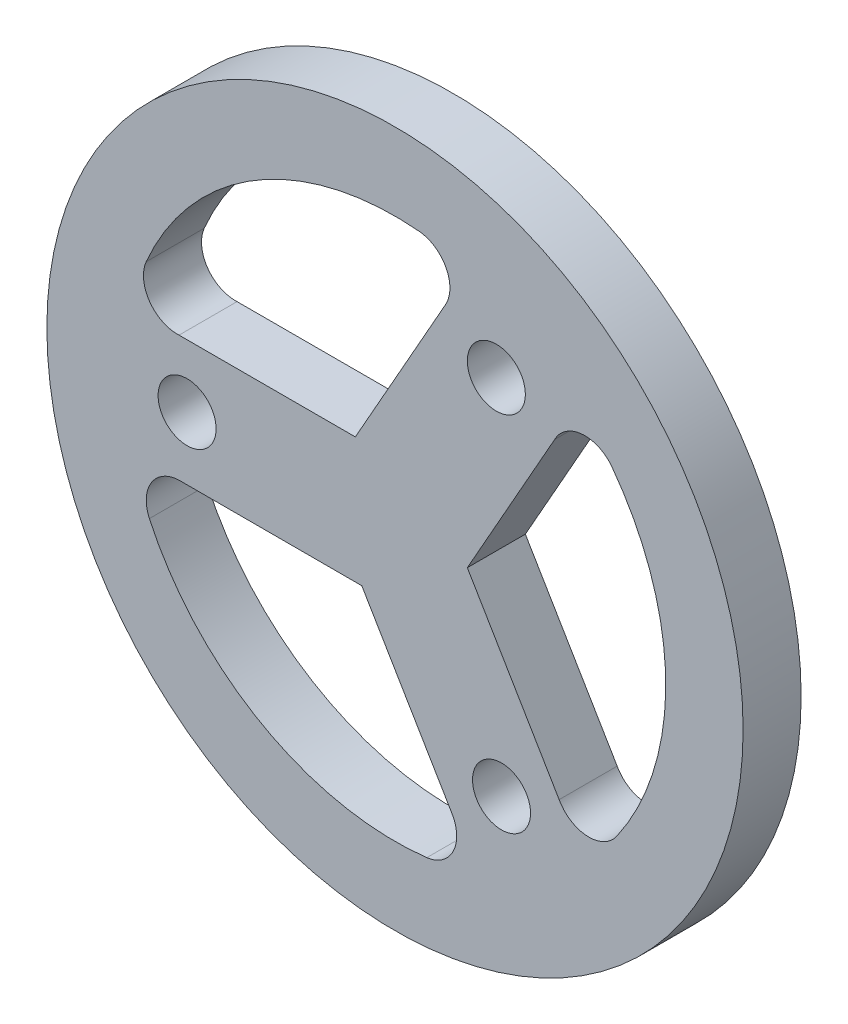
ISO-10303-21;
HEADER;
FILE_DESCRIPTION(('STEP AP214'),'2;1');
FILE_NAME('part.step','',(''),(''),'','','');
FILE_SCHEMA(('AUTOMOTIVE_DESIGN { 1 0 10303 214 1 1 1 1 }'));
ENDSEC;
DATA;
#1=APPLICATION_CONTEXT('core data for automotive mechanical design processes');
#2=APPLICATION_PROTOCOL_DEFINITION('international standard','automotive_design',2000,#1);
#3=PRODUCT_CONTEXT('',#1,'mechanical');
#4=PRODUCT('Part','Part','',(#3));
#5=PRODUCT_RELATED_PRODUCT_CATEGORY('part','',(#4));
#6=PRODUCT_DEFINITION_FORMATION('','',#4);
#7=PRODUCT_DEFINITION_CONTEXT('part definition',#1,'design');
#8=PRODUCT_DEFINITION('design','',#6,#7);
#9=PRODUCT_DEFINITION_SHAPE('','',#8);
#10=(LENGTH_UNIT() NAMED_UNIT(*) SI_UNIT(.MILLI.,.METRE.));
#11=(NAMED_UNIT(*) PLANE_ANGLE_UNIT() SI_UNIT($,.RADIAN.));
#12=(NAMED_UNIT(*) SI_UNIT($,.STERADIAN.) SOLID_ANGLE_UNIT());
#13=UNCERTAINTY_MEASURE_WITH_UNIT(LENGTH_MEASURE(1.E-05),#10,'distance_accuracy_value','');
#14=(GEOMETRIC_REPRESENTATION_CONTEXT(3) GLOBAL_UNCERTAINTY_ASSIGNED_CONTEXT((#13)) GLOBAL_UNIT_ASSIGNED_CONTEXT((#10,
#11,#12)) REPRESENTATION_CONTEXT('',''));
#15=CARTESIAN_POINT('',(0.,0.,0.));
#16=DIRECTION('',(0.,0.,1.));
#17=DIRECTION('',(1.,0.,0.));
#18=AXIS2_PLACEMENT_3D('',#15,#16,#17);
#19=CARTESIAN_POINT('',(0.,0.,3.));
#20=DIRECTION('',(0.,0.,1.));
#21=DIRECTION('',(1.,0.,0.));
#22=AXIS2_PLACEMENT_3D('',#19,#20,#21);
#23=PLANE('',#22);
#24=CARTESIAN_POINT('',(5.24045327565877,9.38616798622511,3.));
#25=DIRECTION('',(0.,0.,1.));
#26=DIRECTION('',(1.,0.,0.));
#27=AXIS2_PLACEMENT_3D('',#24,#25,#26);
#28=CIRCLE('',#27,1.49999999999964);
#29=CARTESIAN_POINT('',(6.74045327565841,9.38616798622511,3.));
#30=VERTEX_POINT('',#29);
#31=EDGE_CURVE('E178',#30,#30,#28,.T.);
#32=ORIENTED_EDGE('',*,*,#31,.F.);
#33=EDGE_LOOP('',(#32));
#34=FACE_BOUND('',#33,.T.);
#35=CARTESIAN_POINT('',(1.08966141724626,12.2014399968107,3.));
#36=DIRECTION('',(0.,0.,1.));
#37=DIRECTION('',(1.,0.,0.));
#38=AXIS2_PLACEMENT_3D('',#35,#36,#37);
#39=CIRCLE('',#38,1.74999999999958);
#40=CARTESIAN_POINT('',(2.58509341993936,11.2924938348628,3.));
#41=VERTEX_POINT('',#40);
#42=CARTESIAN_POINT('',(1.24532733399569,13.9445028534976,3.));
#43=VERTEX_POINT('',#42);
#44=EDGE_CURVE('E246',#41,#43,#39,.T.);
#45=ORIENTED_EDGE('',*,*,#44,.F.);
#46=DIRECTION('',(0.491860621701086,0.870673950925271,0.));
#47=VECTOR('',#46,1.);
#48=CARTESIAN_POINT('',(2.58509341993926,11.2924938348629,3.));
#49=LINE('',#48,#47);
#50=CARTESIAN_POINT('',(-2.05012200752725,3.08740249076528,3.));
#51=VERTEX_POINT('',#50);
#52=EDGE_CURVE('E244',#51,#41,#49,.T.);
#53=ORIENTED_EDGE('',*,*,#52,.F.);
#54=DIRECTION('',(1.,0.,0.));
#55=VECTOR('',#54,1.);
#56=CARTESIAN_POINT('',(-11.1656200392104,3.08740249076528,3.));
#57=LINE('',#56,#55);
#58=CARTESIAN_POINT('',(-11.1656200392104,3.08740249076528,3.));
#59=VERTEX_POINT('',#58);
#60=EDGE_CURVE('E254',#59,#51,#57,.T.);
#61=ORIENTED_EDGE('',*,*,#60,.F.);
#62=CARTESIAN_POINT('',(-11.2554135488902,4.83509729410464,3.));
#63=DIRECTION('',(0.,0.,1.));
#64=DIRECTION('',(1.,0.,0.));
#65=AXIS2_PLACEMENT_3D('',#62,#63,#64);
#66=CIRCLE('',#65,1.75000000000001);
#67=CARTESIAN_POINT('',(-12.8633297701603,5.52582547897669,3.));
#68=VERTEX_POINT('',#67);
#69=EDGE_CURVE('E251',#68,#59,#66,.T.);
#70=ORIENTED_EDGE('',*,*,#69,.F.);
#71=CARTESIAN_POINT('',(0.,0.,3.));
#72=DIRECTION('',(0.,0.,1.));
#73=DIRECTION('',(1.,0.,0.));
#74=AXIS2_PLACEMENT_3D('',#71,#72,#73);
#75=CIRCLE('',#74,14.);
#76=EDGE_CURVE('E249',#43,#68,#75,.T.);
#77=ORIENTED_EDGE('',*,*,#76,.F.);
#78=EDGE_LOOP('',(#45,#53,#61,#70,#77));
#79=FACE_BOUND('',#78,.T.);
#80=CARTESIAN_POINT('',(0.,0.,3.));
#81=DIRECTION('',(0.,0.,1.));
#82=DIRECTION('',(1.,0.,0.));
#83=AXIS2_PLACEMENT_3D('',#80,#81,#82);
#84=CIRCLE('',#83,18.);
#85=CARTESIAN_POINT('',(18.,0.,3.));
#86=VERTEX_POINT('',#85);
#87=EDGE_CURVE('E11',#86,#86,#84,.T.);
#88=ORIENTED_EDGE('',*,*,#87,.T.);
#89=EDGE_LOOP('',(#88));
#90=FACE_BOUND('',#89,.T.);
#91=CARTESIAN_POINT('',(5.5084332824298,-9.23144965717842,3.));
#92=DIRECTION('',(0.,0.,1.));
#93=DIRECTION('',(1.,0.,0.));
#94=AXIS2_PLACEMENT_3D('',#91,#92,#93);
#95=CIRCLE('',#94,1.49999999999968);
#96=CARTESIAN_POINT('',(7.00843328242948,-9.23144965717842,3.));
#97=VERTEX_POINT('',#96);
#98=EDGE_CURVE('E238',#97,#97,#95,.T.);
#99=ORIENTED_EDGE('',*,*,#98,.F.);
#100=EDGE_LOOP('',(#99));
#101=FACE_BOUND('',#100,.T.);
#102=CARTESIAN_POINT('',(5.63653638202065,-9.4461345329261,3.));
#103=DIRECTION('',(0.,0.,-1.));
#104=DIRECTION('',(1.,0.,0.));
#105=AXIS2_PLACEMENT_3D('',#102,#103,#104);
#106=CIRCLE('',#105,3.25000000000002);
#107=CARTESIAN_POINT('',(2.90904103089509,-11.2134118483434,3.));
#108=VERTEX_POINT('',#107);
#109=CARTESIAN_POINT('',(2.77697806435651,-10.99061704428,3.));
#110=VERTEX_POINT('',#109);
#111=EDGE_CURVE('E195',#108,#110,#106,.T.);
#112=ORIENTED_EDGE('',*,*,#111,.F.);
#113=CARTESIAN_POINT('',(1.4403896879811,-12.1650227104908,3.));
#114=DIRECTION('',(0.,0.,1.));
#115=DIRECTION('',(1.,0.,0.));
#116=AXIS2_PLACEMENT_3D('',#113,#114,#115);
#117=CIRCLE('',#116,1.75000000000001);
#118=CARTESIAN_POINT('',(1.64615964340708,-13.9028830977038,3.));
#119=VERTEX_POINT('',#118);
#120=EDGE_CURVE('E193',#119,#108,#117,.T.);
#121=ORIENTED_EDGE('',*,*,#120,.F.);
#122=CARTESIAN_POINT('',(0.,0.,3.));
#123=DIRECTION('',(0.,0.,1.));
#124=DIRECTION('',(1.,0.,0.));
#125=AXIS2_PLACEMENT_3D('',#122,#123,#124);
#126=CIRCLE('',#125,14.);
#127=CARTESIAN_POINT('',(-12.6989573812714,-5.8937663194814,3.));
#128=VERTEX_POINT('',#127);
#129=EDGE_CURVE('E205',#128,#119,#126,.T.);
#130=ORIENTED_EDGE('',*,*,#129,.F.);
#131=CARTESIAN_POINT('',(-11.1115877086127,-5.15704552954634,3.));
#132=DIRECTION('',(0.,0.,1.));
#133=DIRECTION('',(1.,0.,0.));
#134=AXIS2_PLACEMENT_3D('',#131,#132,#133);
#135=CIRCLE('',#134,1.74999999999958);
#136=CARTESIAN_POINT('',(-11.07213324304,-3.40749034460804,3.));
#137=VERTEX_POINT('',#136);
#138=EDGE_CURVE('E202',#137,#128,#135,.T.);
#139=ORIENTED_EDGE('',*,*,#138,.F.);
#140=DIRECTION('',(-0.999999973210807,0.000231470052131784,0.));
#141=VECTOR('',#140,1.);
#142=CARTESIAN_POINT('',(-11.07213324304,-3.40749034460804,3.));
#143=LINE('',#142,#141);
#144=CARTESIAN_POINT('',(-1.71668249725915,-3.4096558513379,3.));
#145=VERTEX_POINT('',#144);
#146=EDGE_CURVE('E200',#145,#137,#143,.T.);
#147=ORIENTED_EDGE('',*,*,#146,.F.);
#148=DIRECTION('',(-0.509906448719429,0.860229860882741,0.));
#149=VECTOR('',#148,1.);
#150=CARTESIAN_POINT('',(2.77697806435651,-10.99061704428,3.));
#151=LINE('',#150,#149);
#152=EDGE_CURVE('E198',#110,#145,#151,.T.);
#153=ORIENTED_EDGE('',*,*,#152,.F.);
#154=EDGE_LOOP('',(#112,#121,#130,#139,#147,#153));
#155=FACE_BOUND('',#154,.T.);
#156=CARTESIAN_POINT('',(0.,0.,3.));
#157=DIRECTION('',(0.,0.,1.));
#158=DIRECTION('',(1.,0.,0.));
#159=AXIS2_PLACEMENT_3D('',#156,#157,#158);
#160=CIRCLE('',#159,14.);
#161=CARTESIAN_POINT('',(11.4536300472757,-8.05073653401622,3.));
#162=VERTEX_POINT('',#161);
#163=CARTESIAN_POINT('',(11.2171701267533,8.37705761872707,3.));
#164=VERTEX_POINT('',#163);
#165=EDGE_CURVE('E154',#162,#164,#160,.T.);
#166=ORIENTED_EDGE('',*,*,#165,.F.);
#167=CARTESIAN_POINT('',(10.0219262913665,-7.04439446726436,3.));
#168=DIRECTION('',(0.,0.,1.));
#169=DIRECTION('',(1.,0.,0.));
#170=AXIS2_PLACEMENT_3D('',#167,#168,#169);
#171=CIRCLE('',#170,1.74999999999959);
#172=CARTESIAN_POINT('',(8.48703982310076,-7.88500349025481,3.));
#173=VERTEX_POINT('',#172);
#174=EDGE_CURVE('E146',#173,#162,#171,.T.);
#175=ORIENTED_EDGE('',*,*,#174,.F.);
#176=DIRECTION('',(0.509705666222612,-0.860348844260608,0.));
#177=VECTOR('',#176,1.);
#178=CARTESIAN_POINT('',(8.48703982310076,-7.88500349025481,3.));
#179=LINE('',#178,#177);
#180=CARTESIAN_POINT('',(3.74032239780717,0.127135910015121,3.));
#181=VERTEX_POINT('',#180);
#182=EDGE_CURVE('E175',#181,#173,#179,.T.);
#183=ORIENTED_EDGE('',*,*,#182,.F.);
#184=DIRECTION('',(-0.491657400648019,-0.870788723163107,0.));
#185=VECTOR('',#184,1.);
#186=CARTESIAN_POINT('',(8.25657900831527,8.12600935757812,3.));
#187=LINE('',#186,#185);
#188=CARTESIAN_POINT('',(8.25657900831527,8.12600935757811,3.));
#189=VERTEX_POINT('',#188);
#190=EDGE_CURVE('E170',#189,#181,#187,.T.);
#191=ORIENTED_EDGE('',*,*,#190,.F.);
#192=CARTESIAN_POINT('',(9.81502386090915,7.32992541638618,3.));
#193=DIRECTION('',(0.,0.,1.));
#194=DIRECTION('',(1.,0.,0.));
#195=AXIS2_PLACEMENT_3D('',#192,#193,#194);
#196=CIRCLE('',#195,1.75000000000001);
#197=EDGE_CURVE('E168',#164,#189,#196,.T.);
#198=ORIENTED_EDGE('',*,*,#197,.F.);
#199=EDGE_LOOP('',(#166,#175,#183,#191,#198));
#200=FACE_BOUND('',#199,.T.);
#201=CARTESIAN_POINT('',(-10.7488865580886,-0.15471832904669,3.));
#202=DIRECTION('',(0.,0.,1.));
#203=DIRECTION('',(1.,0.,0.));
#204=AXIS2_PLACEMENT_3D('',#201,#202,#203);
#205=CIRCLE('',#204,1.49999999999971);
#206=CARTESIAN_POINT('',(-9.24888655808885,-0.15471832904669,3.));
#207=VERTEX_POINT('',#206);
#208=EDGE_CURVE('E302',#207,#207,#205,.T.);
#209=ORIENTED_EDGE('',*,*,#208,.F.);
#210=EDGE_LOOP('',(#209));
#211=FACE_BOUND('',#210,.T.);
#212=ADVANCED_FACE('F33',(#34,#79,#90,#101,#155,#200,#211),#23,.T.);
#213=CARTESIAN_POINT('',(0.,0.,0.));
#214=DIRECTION('',(0.,0.,1.));
#215=DIRECTION('',(1.,0.,0.));
#216=AXIS2_PLACEMENT_3D('',#213,#214,#215);
#217=PLANE('',#216);
#218=CARTESIAN_POINT('',(1.4403896879811,-12.1650227104908,0.));
#219=DIRECTION('',(0.,0.,1.));
#220=DIRECTION('',(1.,0.,0.));
#221=AXIS2_PLACEMENT_3D('',#218,#219,#220);
#222=CIRCLE('',#221,1.75000000000001);
#223=CARTESIAN_POINT('',(1.64615964340708,-13.9028830977038,0.));
#224=VERTEX_POINT('',#223);
#225=CARTESIAN_POINT('',(2.90904103089509,-11.2134118483434,0.));
#226=VERTEX_POINT('',#225);
#227=EDGE_CURVE('E162',#224,#226,#222,.T.);
#228=ORIENTED_EDGE('',*,*,#227,.T.);
#229=CARTESIAN_POINT('',(5.63653638202065,-9.4461345329261,0.));
#230=DIRECTION('',(0.,0.,-1.));
#231=DIRECTION('',(1.,0.,0.));
#232=AXIS2_PLACEMENT_3D('',#229,#230,#231);
#233=CIRCLE('',#232,3.25000000000002);
#234=CARTESIAN_POINT('',(2.77697806435651,-10.99061704428,0.));
#235=VERTEX_POINT('',#234);
#236=EDGE_CURVE('E210',#226,#235,#233,.T.);
#237=ORIENTED_EDGE('',*,*,#236,.T.);
#238=DIRECTION('',(-0.509906448719429,0.860229860882741,0.));
#239=VECTOR('',#238,1.);
#240=CARTESIAN_POINT('',(2.77697806435651,-10.99061704428,0.));
#241=LINE('',#240,#239);
#242=CARTESIAN_POINT('',(-1.71668249725915,-3.4096558513379,0.));
#243=VERTEX_POINT('',#242);
#244=EDGE_CURVE('E213',#235,#243,#241,.T.);
#245=ORIENTED_EDGE('',*,*,#244,.T.);
#246=DIRECTION('',(-0.999999973210807,0.000231470052131784,0.));
#247=VECTOR('',#246,1.);
#248=CARTESIAN_POINT('',(-11.07213324304,-3.40749034460804,0.));
#249=LINE('',#248,#247);
#250=CARTESIAN_POINT('',(-11.07213324304,-3.40749034460804,0.));
#251=VERTEX_POINT('',#250);
#252=EDGE_CURVE('E216',#243,#251,#249,.T.);
#253=ORIENTED_EDGE('',*,*,#252,.T.);
#254=CARTESIAN_POINT('',(-11.1115877086127,-5.15704552954634,0.));
#255=DIRECTION('',(0.,0.,1.));
#256=DIRECTION('',(1.,0.,0.));
#257=AXIS2_PLACEMENT_3D('',#254,#255,#256);
#258=CIRCLE('',#257,1.74999999999958);
#259=CARTESIAN_POINT('',(-12.6989573812713,-5.89376631948135,0.));
#260=VERTEX_POINT('',#259);
#261=EDGE_CURVE('E219',#251,#260,#258,.T.);
#262=ORIENTED_EDGE('',*,*,#261,.T.);
#263=CARTESIAN_POINT('',(0.,0.,0.));
#264=DIRECTION('',(0.,0.,1.));
#265=DIRECTION('',(1.,0.,0.));
#266=AXIS2_PLACEMENT_3D('',#263,#264,#265);
#267=CIRCLE('',#266,14.);
#268=EDGE_CURVE('E196',#260,#224,#267,.T.);
#269=ORIENTED_EDGE('',*,*,#268,.T.);
#270=EDGE_LOOP('',(#228,#237,#245,#253,#262,#269));
#271=FACE_BOUND('',#270,.T.);
#272=CARTESIAN_POINT('',(0.,0.,0.));
#273=DIRECTION('',(0.,0.,1.));
#274=DIRECTION('',(1.,0.,0.));
#275=AXIS2_PLACEMENT_3D('',#272,#273,#274);
#276=CIRCLE('',#275,18.);
#277=CARTESIAN_POINT('',(18.,0.,0.));
#278=VERTEX_POINT('',#277);
#279=EDGE_CURVE('E37',#278,#278,#276,.T.);
#280=ORIENTED_EDGE('',*,*,#279,.F.);
#281=EDGE_LOOP('',(#280));
#282=FACE_BOUND('',#281,.T.);
#283=DIRECTION('',(0.491860621701086,0.870673950925271,0.));
#284=VECTOR('',#283,1.);
#285=CARTESIAN_POINT('',(2.58509341993926,11.2924938348629,0.));
#286=LINE('',#285,#284);
#287=CARTESIAN_POINT('',(-2.05012200752725,3.08740249076528,0.));
#288=VERTEX_POINT('',#287);
#289=CARTESIAN_POINT('',(2.58509341993936,11.2924938348628,0.));
#290=VERTEX_POINT('',#289);
#291=EDGE_CURVE('E241',#288,#290,#286,.T.);
#292=ORIENTED_EDGE('',*,*,#291,.T.);
#293=CARTESIAN_POINT('',(1.08966141724626,12.2014399968107,0.));
#294=DIRECTION('',(0.,0.,1.));
#295=DIRECTION('',(1.,0.,0.));
#296=AXIS2_PLACEMENT_3D('',#293,#294,#295);
#297=CIRCLE('',#296,1.74999999999958);
#298=CARTESIAN_POINT('',(1.24532733399569,13.9445028534976,0.));
#299=VERTEX_POINT('',#298);
#300=EDGE_CURVE('E259',#290,#299,#297,.T.);
#301=ORIENTED_EDGE('',*,*,#300,.T.);
#302=CARTESIAN_POINT('',(0.,0.,0.));
#303=DIRECTION('',(0.,0.,1.));
#304=DIRECTION('',(1.,0.,0.));
#305=AXIS2_PLACEMENT_3D('',#302,#303,#304);
#306=CIRCLE('',#305,14.);
#307=CARTESIAN_POINT('',(-12.8633297701603,5.52582547897669,0.));
#308=VERTEX_POINT('',#307);
#309=EDGE_CURVE('E262',#299,#308,#306,.T.);
#310=ORIENTED_EDGE('',*,*,#309,.T.);
#311=CARTESIAN_POINT('',(-11.2554135488902,4.83509729410464,0.));
#312=DIRECTION('',(0.,0.,1.));
#313=DIRECTION('',(1.,0.,0.));
#314=AXIS2_PLACEMENT_3D('',#311,#312,#313);
#315=CIRCLE('',#314,1.75000000000001);
#316=CARTESIAN_POINT('',(-11.1656200392104,3.08740249076528,0.));
#317=VERTEX_POINT('',#316);
#318=EDGE_CURVE('E265',#308,#317,#315,.T.);
#319=ORIENTED_EDGE('',*,*,#318,.T.);
#320=DIRECTION('',(1.,0.,0.));
#321=VECTOR('',#320,1.);
#322=CARTESIAN_POINT('',(-11.1656200392104,3.08740249076528,0.));
#323=LINE('',#322,#321);
#324=EDGE_CURVE('E247',#317,#288,#323,.T.);
#325=ORIENTED_EDGE('',*,*,#324,.T.);
#326=EDGE_LOOP('',(#292,#301,#310,#319,#325));
#327=FACE_BOUND('',#326,.T.);
#328=CARTESIAN_POINT('',(5.5084332824298,-9.23144965717842,0.));
#329=DIRECTION('',(0.,0.,1.));
#330=DIRECTION('',(1.,0.,0.));
#331=AXIS2_PLACEMENT_3D('',#328,#329,#330);
#332=CIRCLE('',#331,1.49999999999968);
#333=CARTESIAN_POINT('',(7.00843328242948,-9.23144965717842,0.));
#334=VERTEX_POINT('',#333);
#335=EDGE_CURVE('E237',#334,#334,#332,.T.);
#336=ORIENTED_EDGE('',*,*,#335,.T.);
#337=EDGE_LOOP('',(#336));
#338=FACE_BOUND('',#337,.T.);
#339=CARTESIAN_POINT('',(10.0219262913665,-7.04439446726436,0.));
#340=DIRECTION('',(0.,0.,1.));
#341=DIRECTION('',(1.,0.,0.));
#342=AXIS2_PLACEMENT_3D('',#339,#340,#341);
#343=CIRCLE('',#342,1.74999999999959);
#344=CARTESIAN_POINT('',(8.48703982310076,-7.88500349025481,0.));
#345=VERTEX_POINT('',#344);
#346=CARTESIAN_POINT('',(11.4536300472757,-8.05073653401622,0.));
#347=VERTEX_POINT('',#346);
#348=EDGE_CURVE('E56',#345,#347,#343,.T.);
#349=ORIENTED_EDGE('',*,*,#348,.T.);
#350=CARTESIAN_POINT('',(0.,0.,0.));
#351=DIRECTION('',(0.,0.,1.));
#352=DIRECTION('',(1.,0.,0.));
#353=AXIS2_PLACEMENT_3D('',#350,#351,#352);
#354=CIRCLE('',#353,14.);
#355=CARTESIAN_POINT('',(11.2171701267533,8.37705761872707,0.));
#356=VERTEX_POINT('',#355);
#357=EDGE_CURVE('E161',#347,#356,#354,.T.);
#358=ORIENTED_EDGE('',*,*,#357,.T.);
#359=CARTESIAN_POINT('',(9.81502386090915,7.32992541638618,0.));
#360=DIRECTION('',(0.,0.,1.));
#361=DIRECTION('',(1.,0.,0.));
#362=AXIS2_PLACEMENT_3D('',#359,#360,#361);
#363=CIRCLE('',#362,1.75000000000001);
#364=CARTESIAN_POINT('',(8.25657900831527,8.12600935757811,0.));
#365=VERTEX_POINT('',#364);
#366=EDGE_CURVE('E180',#356,#365,#363,.T.);
#367=ORIENTED_EDGE('',*,*,#366,.T.);
#368=DIRECTION('',(-0.491657400648019,-0.870788723163107,0.));
#369=VECTOR('',#368,1.);
#370=CARTESIAN_POINT('',(8.25657900831527,8.12600935757812,0.));
#371=LINE('',#370,#369);
#372=CARTESIAN_POINT('',(3.74032239780717,0.127135910015121,0.));
#373=VERTEX_POINT('',#372);
#374=EDGE_CURVE('E183',#365,#373,#371,.T.);
#375=ORIENTED_EDGE('',*,*,#374,.T.);
#376=DIRECTION('',(0.509705666222612,-0.860348844260608,0.));
#377=VECTOR('',#376,1.);
#378=CARTESIAN_POINT('',(8.48703982310076,-7.88500349025481,0.));
#379=LINE('',#378,#377);
#380=EDGE_CURVE('E155',#373,#345,#379,.T.);
#381=ORIENTED_EDGE('',*,*,#380,.T.);
#382=EDGE_LOOP('',(#349,#358,#367,#375,#381));
#383=FACE_BOUND('',#382,.T.);
#384=CARTESIAN_POINT('',(5.24045327565877,9.38616798622511,0.));
#385=DIRECTION('',(0.,0.,1.));
#386=DIRECTION('',(1.,0.,0.));
#387=AXIS2_PLACEMENT_3D('',#384,#385,#386);
#388=CIRCLE('',#387,1.49999999999964);
#389=CARTESIAN_POINT('',(6.74045327565841,9.38616798622511,0.));
#390=VERTEX_POINT('',#389);
#391=EDGE_CURVE('E297',#390,#390,#388,.T.);
#392=ORIENTED_EDGE('',*,*,#391,.T.);
#393=EDGE_LOOP('',(#392));
#394=FACE_BOUND('',#393,.T.);
#395=CARTESIAN_POINT('',(-10.7488865580886,-0.15471832904669,0.));
#396=DIRECTION('',(0.,0.,1.));
#397=DIRECTION('',(1.,0.,0.));
#398=AXIS2_PLACEMENT_3D('',#395,#396,#397);
#399=CIRCLE('',#398,1.49999999999971);
#400=CARTESIAN_POINT('',(-9.24888655808885,-0.15471832904669,0.));
#401=VERTEX_POINT('',#400);
#402=EDGE_CURVE('E300',#401,#401,#399,.T.);
#403=ORIENTED_EDGE('',*,*,#402,.T.);
#404=EDGE_LOOP('',(#403));
#405=FACE_BOUND('',#404,.T.);
#406=ADVANCED_FACE('F286',(#271,#282,#327,#338,#383,#394,#405),#217,.F.);
#407=CARTESIAN_POINT('',(0.,0.,3.));
#408=DIRECTION('',(0.,0.,-1.));
#409=DIRECTION('',(-1.,0.,0.));
#410=AXIS2_PLACEMENT_3D('',#407,#408,#409);
#411=CYLINDRICAL_SURFACE('',#410,18.);
#412=ORIENTED_EDGE('',*,*,#87,.F.);
#413=EDGE_LOOP('',(#412));
#414=FACE_BOUND('',#413,.T.);
#415=ORIENTED_EDGE('',*,*,#279,.T.);
#416=EDGE_LOOP('',(#415));
#417=FACE_BOUND('',#416,.T.);
#418=ADVANCED_FACE('F35',(#414,#417),#411,.T.);
#419=CARTESIAN_POINT('',(2.58509341993926,11.2924938348629,3.));
#420=DIRECTION('',(-0.870673950925271,0.491860621701086,0.));
#421=DIRECTION('',(-0.491860621701086,-0.870673950925271,0.));
#422=AXIS2_PLACEMENT_3D('',#419,#420,#421);
#423=PLANE('',#422);
#424=ORIENTED_EDGE('',*,*,#291,.F.);
#425=DIRECTION('',(0.,0.,-1.));
#426=VECTOR('',#425,1.);
#427=CARTESIAN_POINT('',(-2.05012200752725,3.08740249076528,3.));
#428=LINE('',#427,#426);
#429=EDGE_CURVE('E256',#51,#288,#428,.T.);
#430=ORIENTED_EDGE('',*,*,#429,.F.);
#431=ORIENTED_EDGE('',*,*,#52,.T.);
#432=DIRECTION('',(0.,0.,-1.));
#433=VECTOR('',#432,1.);
#434=CARTESIAN_POINT('',(2.58509341993936,11.2924938348628,3.));
#435=LINE('',#434,#433);
#436=EDGE_CURVE('E278',#41,#290,#435,.T.);
#437=ORIENTED_EDGE('',*,*,#436,.T.);
#438=EDGE_LOOP('',(#424,#430,#431,#437));
#439=FACE_BOUND('',#438,.T.);
#440=ADVANCED_FACE('F384',(#439),#423,.T.);
#441=CARTESIAN_POINT('',(1.08966141724626,12.2014399968107,3.));
#442=DIRECTION('',(0.,0.,-1.));
#443=DIRECTION('',(-1.,0.,0.));
#444=AXIS2_PLACEMENT_3D('',#441,#442,#443);
#445=CYLINDRICAL_SURFACE('',#444,1.74999999999958);
#446=ORIENTED_EDGE('',*,*,#300,.F.);
#447=ORIENTED_EDGE('',*,*,#436,.F.);
#448=ORIENTED_EDGE('',*,*,#44,.T.);
#449=DIRECTION('',(0.,0.,-1.));
#450=VECTOR('',#449,1.);
#451=CARTESIAN_POINT('',(1.24532733399569,13.9445028534976,3.));
#452=LINE('',#451,#450);
#453=EDGE_CURVE('E276',#43,#299,#452,.T.);
#454=ORIENTED_EDGE('',*,*,#453,.T.);
#455=EDGE_LOOP('',(#446,#447,#448,#454));
#456=FACE_BOUND('',#455,.T.);
#457=ADVANCED_FACE('F380',(#456),#445,.F.);
#458=CARTESIAN_POINT('',(0.,0.,3.));
#459=DIRECTION('',(0.,0.,-1.));
#460=DIRECTION('',(-1.,0.,0.));
#461=AXIS2_PLACEMENT_3D('',#458,#459,#460);
#462=CYLINDRICAL_SURFACE('',#461,14.);
#463=ORIENTED_EDGE('',*,*,#309,.F.);
#464=ORIENTED_EDGE('',*,*,#453,.F.);
#465=ORIENTED_EDGE('',*,*,#76,.T.);
#466=DIRECTION('',(0.,0.,-1.));
#467=VECTOR('',#466,1.);
#468=CARTESIAN_POINT('',(-12.8633297701603,5.52582547897669,3.));
#469=LINE('',#468,#467);
#470=EDGE_CURVE('E274',#68,#308,#469,.T.);
#471=ORIENTED_EDGE('',*,*,#470,.T.);
#472=EDGE_LOOP('',(#463,#464,#465,#471));
#473=FACE_BOUND('',#472,.T.);
#474=ADVANCED_FACE('F376',(#473),#462,.F.);
#475=CARTESIAN_POINT('',(-11.2554135488902,4.83509729410464,3.));
#476=DIRECTION('',(0.,0.,-1.));
#477=DIRECTION('',(-1.,0.,0.));
#478=AXIS2_PLACEMENT_3D('',#475,#476,#477);
#479=CYLINDRICAL_SURFACE('',#478,1.75000000000001);
#480=ORIENTED_EDGE('',*,*,#318,.F.);
#481=ORIENTED_EDGE('',*,*,#470,.F.);
#482=ORIENTED_EDGE('',*,*,#69,.T.);
#483=DIRECTION('',(0.,0.,-1.));
#484=VECTOR('',#483,1.);
#485=CARTESIAN_POINT('',(-11.1656200392104,3.08740249076528,3.));
#486=LINE('',#485,#484);
#487=EDGE_CURVE('E272',#59,#317,#486,.T.);
#488=ORIENTED_EDGE('',*,*,#487,.T.);
#489=EDGE_LOOP('',(#480,#481,#482,#488));
#490=FACE_BOUND('',#489,.T.);
#491=ADVANCED_FACE('F372',(#490),#479,.F.);
#492=CARTESIAN_POINT('',(-11.1656200392104,3.08740249076528,3.));
#493=DIRECTION('',(0.,1.,0.));
#494=DIRECTION('',(-1.,0.,0.));
#495=AXIS2_PLACEMENT_3D('',#492,#493,#494);
#496=PLANE('',#495);
#497=ORIENTED_EDGE('',*,*,#324,.F.);
#498=ORIENTED_EDGE('',*,*,#487,.F.);
#499=ORIENTED_EDGE('',*,*,#60,.T.);
#500=ORIENTED_EDGE('',*,*,#429,.T.);
#501=EDGE_LOOP('',(#497,#498,#499,#500));
#502=FACE_BOUND('',#501,.T.);
#503=ADVANCED_FACE('F368',(#502),#496,.T.);
#504=CARTESIAN_POINT('',(5.5084332824298,-9.23144965717842,3.));
#505=DIRECTION('',(0.,0.,-1.));
#506=DIRECTION('',(-1.,0.,0.));
#507=AXIS2_PLACEMENT_3D('',#504,#505,#506);
#508=CYLINDRICAL_SURFACE('',#507,1.49999999999968);
#509=ORIENTED_EDGE('',*,*,#98,.T.);
#510=EDGE_LOOP('',(#509));
#511=FACE_BOUND('',#510,.T.);
#512=ORIENTED_EDGE('',*,*,#335,.F.);
#513=EDGE_LOOP('',(#512));
#514=FACE_BOUND('',#513,.T.);
#515=ADVANCED_FACE('F365',(#511,#514),#508,.F.);
#516=CARTESIAN_POINT('',(1.4403896879811,-12.1650227104908,3.));
#517=DIRECTION('',(0.,0.,-1.));
#518=DIRECTION('',(-1.,0.,0.));
#519=AXIS2_PLACEMENT_3D('',#516,#517,#518);
#520=CYLINDRICAL_SURFACE('',#519,1.75000000000001);
#521=ORIENTED_EDGE('',*,*,#227,.F.);
#522=DIRECTION('',(0.,0.,-1.));
#523=VECTOR('',#522,1.);
#524=CARTESIAN_POINT('',(1.64615964340708,-13.9028830977038,3.));
#525=LINE('',#524,#523);
#526=EDGE_CURVE('E207',#119,#224,#525,.T.);
#527=ORIENTED_EDGE('',*,*,#526,.F.);
#528=ORIENTED_EDGE('',*,*,#120,.T.);
#529=DIRECTION('',(0.,0.,-1.));
#530=VECTOR('',#529,1.);
#531=CARTESIAN_POINT('',(2.90904103089509,-11.2134118483434,3.));
#532=LINE('',#531,#530);
#533=EDGE_CURVE('E234',#108,#226,#532,.T.);
#534=ORIENTED_EDGE('',*,*,#533,.T.);
#535=EDGE_LOOP('',(#521,#527,#528,#534));
#536=FACE_BOUND('',#535,.T.);
#537=ADVANCED_FACE('F339',(#536),#520,.F.);
#538=CARTESIAN_POINT('',(5.63653638202065,-9.4461345329261,3.));
#539=DIRECTION('',(0.,0.,-1.));
#540=DIRECTION('',(-1.,0.,0.));
#541=AXIS2_PLACEMENT_3D('',#538,#539,#540);
#542=CYLINDRICAL_SURFACE('',#541,3.25000000000002);
#543=ORIENTED_EDGE('',*,*,#236,.F.);
#544=ORIENTED_EDGE('',*,*,#533,.F.);
#545=ORIENTED_EDGE('',*,*,#111,.T.);
#546=DIRECTION('',(0.,0.,-1.));
#547=VECTOR('',#546,1.);
#548=CARTESIAN_POINT('',(2.77697806435651,-10.99061704428,3.));
#549=LINE('',#548,#547);
#550=EDGE_CURVE('E232',#110,#235,#549,.T.);
#551=ORIENTED_EDGE('',*,*,#550,.T.);
#552=EDGE_LOOP('',(#543,#544,#545,#551));
#553=FACE_BOUND('',#552,.T.);
#554=ADVANCED_FACE('F332',(#553),#542,.T.);
#555=CARTESIAN_POINT('',(2.77697806435651,-10.99061704428,3.));
#556=DIRECTION('',(-0.860229860882741,-0.509906448719429,0.));
#557=DIRECTION('',(0.509906448719429,-0.860229860882742,0.));
#558=AXIS2_PLACEMENT_3D('',#555,#556,#557);
#559=PLANE('',#558);
#560=ORIENTED_EDGE('',*,*,#244,.F.);
#561=ORIENTED_EDGE('',*,*,#550,.F.);
#562=ORIENTED_EDGE('',*,*,#152,.T.);
#563=DIRECTION('',(0.,0.,-1.));
#564=VECTOR('',#563,1.);
#565=CARTESIAN_POINT('',(-1.71668249725915,-3.4096558513379,3.));
#566=LINE('',#565,#564);
#567=EDGE_CURVE('E230',#145,#243,#566,.T.);
#568=ORIENTED_EDGE('',*,*,#567,.T.);
#569=EDGE_LOOP('',(#560,#561,#562,#568));
#570=FACE_BOUND('',#569,.T.);
#571=ADVANCED_FACE('F335',(#570),#559,.T.);
#572=CARTESIAN_POINT('',(-11.07213324304,-3.40749034460804,3.));
#573=DIRECTION('',(-0.000231470052131784,-0.999999973210807,0.));
#574=DIRECTION('',(0.999999973210807,-0.000231470052131784,0.));
#575=AXIS2_PLACEMENT_3D('',#572,#573,#574);
#576=PLANE('',#575);
#577=ORIENTED_EDGE('',*,*,#252,.F.);
#578=ORIENTED_EDGE('',*,*,#567,.F.);
#579=ORIENTED_EDGE('',*,*,#146,.T.);
#580=DIRECTION('',(0.,0.,-1.));
#581=VECTOR('',#580,1.);
#582=CARTESIAN_POINT('',(-11.07213324304,-3.40749034460804,3.));
#583=LINE('',#582,#581);
#584=EDGE_CURVE('E228',#137,#251,#583,.T.);
#585=ORIENTED_EDGE('',*,*,#584,.T.);
#586=EDGE_LOOP('',(#577,#578,#579,#585));
#587=FACE_BOUND('',#586,.T.);
#588=ADVANCED_FACE('F350',(#587),#576,.T.);
#589=CARTESIAN_POINT('',(-11.1115877086127,-5.15704552954634,3.));
#590=DIRECTION('',(0.,0.,-1.));
#591=DIRECTION('',(-1.,0.,0.));
#592=AXIS2_PLACEMENT_3D('',#589,#590,#591);
#593=CYLINDRICAL_SURFACE('',#592,1.74999999999958);
#594=ORIENTED_EDGE('',*,*,#261,.F.);
#595=ORIENTED_EDGE('',*,*,#584,.F.);
#596=ORIENTED_EDGE('',*,*,#138,.T.);
#597=DIRECTION('',(0.,0.,-1.));
#598=VECTOR('',#597,1.);
#599=CARTESIAN_POINT('',(-12.6989573812713,-5.89376631948135,3.));
#600=LINE('',#599,#598);
#601=EDGE_CURVE('E226',#128,#260,#600,.T.);
#602=ORIENTED_EDGE('',*,*,#601,.T.);
#603=EDGE_LOOP('',(#594,#595,#596,#602));
#604=FACE_BOUND('',#603,.T.);
#605=ADVANCED_FACE('F347',(#604),#593,.F.);
#606=CARTESIAN_POINT('',(0.,0.,3.));
#607=DIRECTION('',(0.,0.,-1.));
#608=DIRECTION('',(-1.,0.,0.));
#609=AXIS2_PLACEMENT_3D('',#606,#607,#608);
#610=CYLINDRICAL_SURFACE('',#609,14.);
#611=ORIENTED_EDGE('',*,*,#268,.F.);
#612=ORIENTED_EDGE('',*,*,#601,.F.);
#613=ORIENTED_EDGE('',*,*,#129,.T.);
#614=ORIENTED_EDGE('',*,*,#526,.T.);
#615=EDGE_LOOP('',(#611,#612,#613,#614));
#616=FACE_BOUND('',#615,.T.);
#617=ADVANCED_FACE('F343',(#616),#610,.F.);
#618=CARTESIAN_POINT('',(10.0219262913665,-7.04439446726436,3.));
#619=DIRECTION('',(0.,0.,-1.));
#620=DIRECTION('',(-1.,0.,0.));
#621=AXIS2_PLACEMENT_3D('',#618,#619,#620);
#622=CYLINDRICAL_SURFACE('',#621,1.74999999999959);
#623=ORIENTED_EDGE('',*,*,#348,.F.);
#624=DIRECTION('',(0.,0.,-1.));
#625=VECTOR('',#624,1.);
#626=CARTESIAN_POINT('',(8.48703982310076,-7.88500349025481,3.));
#627=LINE('',#626,#625);
#628=EDGE_CURVE('E150',#173,#345,#627,.T.);
#629=ORIENTED_EDGE('',*,*,#628,.F.);
#630=ORIENTED_EDGE('',*,*,#174,.T.);
#631=DIRECTION('',(0.,0.,-1.));
#632=VECTOR('',#631,1.);
#633=CARTESIAN_POINT('',(11.4536300472757,-8.05073653401622,3.));
#634=LINE('',#633,#632);
#635=EDGE_CURVE('E149',#162,#347,#634,.T.);
#636=ORIENTED_EDGE('',*,*,#635,.T.);
#637=EDGE_LOOP('',(#623,#629,#630,#636));
#638=FACE_BOUND('',#637,.T.);
#639=ADVANCED_FACE('F148',(#638),#622,.F.);
#640=CARTESIAN_POINT('',(0.,0.,3.));
#641=DIRECTION('',(0.,0.,-1.));
#642=DIRECTION('',(-1.,0.,0.));
#643=AXIS2_PLACEMENT_3D('',#640,#641,#642);
#644=CYLINDRICAL_SURFACE('',#643,14.);
#645=ORIENTED_EDGE('',*,*,#357,.F.);
#646=ORIENTED_EDGE('',*,*,#635,.F.);
#647=ORIENTED_EDGE('',*,*,#165,.T.);
#648=DIRECTION('',(0.,0.,-1.));
#649=VECTOR('',#648,1.);
#650=CARTESIAN_POINT('',(11.2171701267533,8.37705761872707,3.));
#651=LINE('',#650,#649);
#652=EDGE_CURVE('E163',#164,#356,#651,.T.);
#653=ORIENTED_EDGE('',*,*,#652,.T.);
#654=EDGE_LOOP('',(#645,#646,#647,#653));
#655=FACE_BOUND('',#654,.T.);
#656=ADVANCED_FACE('F158',(#655),#644,.F.);
#657=CARTESIAN_POINT('',(9.81502386090915,7.32992541638618,3.));
#658=DIRECTION('',(0.,0.,-1.));
#659=DIRECTION('',(-1.,0.,0.));
#660=AXIS2_PLACEMENT_3D('',#657,#658,#659);
#661=CYLINDRICAL_SURFACE('',#660,1.75000000000001);
#662=ORIENTED_EDGE('',*,*,#366,.F.);
#663=ORIENTED_EDGE('',*,*,#652,.F.);
#664=ORIENTED_EDGE('',*,*,#197,.T.);
#665=DIRECTION('',(0.,0.,-1.));
#666=VECTOR('',#665,1.);
#667=CARTESIAN_POINT('',(8.25657900831527,8.12600935757811,3.));
#668=LINE('',#667,#666);
#669=EDGE_CURVE('E190',#189,#365,#668,.T.);
#670=ORIENTED_EDGE('',*,*,#669,.T.);
#671=EDGE_LOOP('',(#662,#663,#664,#670));
#672=FACE_BOUND('',#671,.T.);
#673=ADVANCED_FACE('F489',(#672),#661,.F.);
#674=CARTESIAN_POINT('',(8.25657900831527,8.12600935757812,3.));
#675=DIRECTION('',(0.870788723163107,-0.491657400648019,0.));
#676=DIRECTION('',(0.491657400648019,0.870788723163107,0.));
#677=AXIS2_PLACEMENT_3D('',#674,#675,#676);
#678=PLANE('',#677);
#679=ORIENTED_EDGE('',*,*,#374,.F.);
#680=ORIENTED_EDGE('',*,*,#669,.F.);
#681=ORIENTED_EDGE('',*,*,#190,.T.);
#682=DIRECTION('',(0.,0.,-1.));
#683=VECTOR('',#682,1.);
#684=CARTESIAN_POINT('',(3.74032239780717,0.127135910015121,3.));
#685=LINE('',#684,#683);
#686=EDGE_CURVE('E48',#181,#373,#685,.T.);
#687=ORIENTED_EDGE('',*,*,#686,.T.);
#688=EDGE_LOOP('',(#679,#680,#681,#687));
#689=FACE_BOUND('',#688,.T.);
#690=ADVANCED_FACE('F497',(#689),#678,.T.);
#691=CARTESIAN_POINT('',(8.48703982310076,-7.88500349025481,3.));
#692=DIRECTION('',(0.860348844260608,0.509705666222612,0.));
#693=DIRECTION('',(-0.509705666222612,0.860348844260608,0.));
#694=AXIS2_PLACEMENT_3D('',#691,#692,#693);
#695=PLANE('',#694);
#696=ORIENTED_EDGE('',*,*,#380,.F.);
#697=ORIENTED_EDGE('',*,*,#686,.F.);
#698=ORIENTED_EDGE('',*,*,#182,.T.);
#699=ORIENTED_EDGE('',*,*,#628,.T.);
#700=EDGE_LOOP('',(#696,#697,#698,#699));
#701=FACE_BOUND('',#700,.T.);
#702=ADVANCED_FACE('F506',(#701),#695,.T.);
#703=CARTESIAN_POINT('',(5.24045327565877,9.38616798622511,3.));
#704=DIRECTION('',(0.,0.,-1.));
#705=DIRECTION('',(-1.,0.,0.));
#706=AXIS2_PLACEMENT_3D('',#703,#704,#705);
#707=CYLINDRICAL_SURFACE('',#706,1.49999999999964);
#708=ORIENTED_EDGE('',*,*,#31,.T.);
#709=EDGE_LOOP('',(#708));
#710=FACE_BOUND('',#709,.T.);
#711=ORIENTED_EDGE('',*,*,#391,.F.);
#712=EDGE_LOOP('',(#711));
#713=FACE_BOUND('',#712,.T.);
#714=ADVANCED_FACE('F310',(#710,#713),#707,.F.);
#715=CARTESIAN_POINT('',(-10.7488865580886,-0.15471832904669,3.));
#716=DIRECTION('',(0.,0.,-1.));
#717=DIRECTION('',(-1.,0.,0.));
#718=AXIS2_PLACEMENT_3D('',#715,#716,#717);
#719=CYLINDRICAL_SURFACE('',#718,1.49999999999971);
#720=ORIENTED_EDGE('',*,*,#208,.T.);
#721=EDGE_LOOP('',(#720));
#722=FACE_BOUND('',#721,.T.);
#723=ORIENTED_EDGE('',*,*,#402,.F.);
#724=EDGE_LOOP('',(#723));
#725=FACE_BOUND('',#724,.T.);
#726=ADVANCED_FACE('F522',(#722,#725),#719,.F.);
#727=CLOSED_SHELL('',(#212,#406,#418,#440,#457,#474,#491,#503,#515,#537,#554,#571,#588,#605,
#617,#639,#656,#673,#690,#702,#714,#726));
#728=MANIFOLD_SOLID_BREP('B2',#727);
#729=ADVANCED_BREP_SHAPE_REPRESENTATION('',(#18,#728),#14);
#730=SHAPE_DEFINITION_REPRESENTATION(#9,#729);
ENDSEC;
END-ISO-10303-21;
